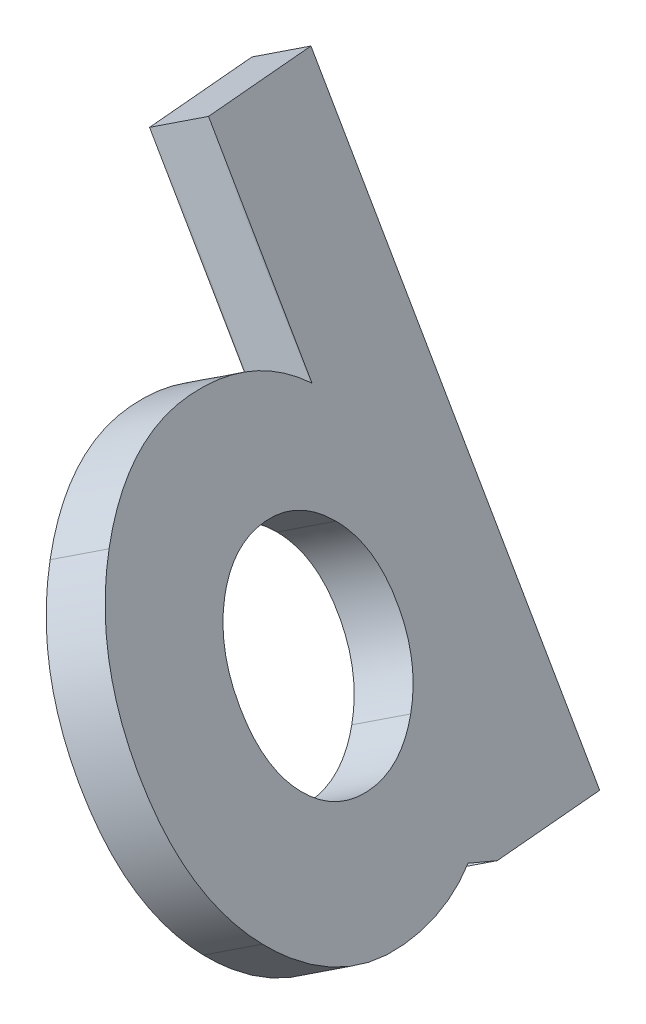
ISO-10303-21;
HEADER;
FILE_DESCRIPTION(('STEP AP214'),'2;1');
FILE_NAME('part.step','',(''),(''),'','','');
FILE_SCHEMA(('AUTOMOTIVE_DESIGN { 1 0 10303 214 1 1 1 1 }'));
ENDSEC;
DATA;
#1=APPLICATION_CONTEXT('core data for automotive mechanical design processes');
#2=APPLICATION_PROTOCOL_DEFINITION('international standard','automotive_design',2000,#1);
#3=PRODUCT_CONTEXT('',#1,'mechanical');
#4=PRODUCT('Part','Part','',(#3));
#5=PRODUCT_RELATED_PRODUCT_CATEGORY('part','',(#4));
#6=PRODUCT_DEFINITION_FORMATION('','',#4);
#7=PRODUCT_DEFINITION_CONTEXT('part definition',#1,'design');
#8=PRODUCT_DEFINITION('design','',#6,#7);
#9=PRODUCT_DEFINITION_SHAPE('','',#8);
#10=(LENGTH_UNIT() NAMED_UNIT(*) SI_UNIT(.MILLI.,.METRE.));
#11=(NAMED_UNIT(*) PLANE_ANGLE_UNIT() SI_UNIT($,.RADIAN.));
#12=(NAMED_UNIT(*) SI_UNIT($,.STERADIAN.) SOLID_ANGLE_UNIT());
#13=UNCERTAINTY_MEASURE_WITH_UNIT(LENGTH_MEASURE(1.E-05),#10,'distance_accuracy_value','');
#14=(GEOMETRIC_REPRESENTATION_CONTEXT(3) GLOBAL_UNCERTAINTY_ASSIGNED_CONTEXT((#13)) GLOBAL_UNIT_ASSIGNED_CONTEXT((#10,
#11,#12)) REPRESENTATION_CONTEXT('',''));
#15=CARTESIAN_POINT('',(0.,0.,0.));
#16=DIRECTION('',(0.,0.,1.));
#17=DIRECTION('',(1.,0.,0.));
#18=AXIS2_PLACEMENT_3D('',#15,#16,#17);
#19=CARTESIAN_POINT('',(8.13974929805619,3.60228000869714,0.00698615585529271));
#20=DIRECTION('',(0.847100670886275,0.489073800366902,-0.207911690817759));
#21=DIRECTION('',(0.,-0.391228817833811,-0.920293438038303));
#22=AXIS2_PLACEMENT_3D('',#19,#20,#21);
#23=PLANE('',#22);
#24=CARTESIAN_POINT('',(7.92501048505287,4.0366960484203,0.153952932024193));
#25=CARTESIAN_POINT('',(7.85690880548298,4.1129926074321,0.0559578154379937));
#26=CARTESIAN_POINT('',(7.78376283362679,4.21886664286758,0.0069861346182927));
#27=CARTESIAN_POINT('',(7.62872130503954,4.48740644766383,0.0069861346182927));
#28=CARTESIAN_POINT('',(7.57395154888874,4.60308895222363,0.0559578154379937));
#29=CARTESIAN_POINT('',(7.54123684543957,4.70141149083617,0.153952932024193));
#30=B_SPLINE_CURVE_WITH_KNOTS('',3,(#24,#25,#26,#27,#28,#29),.UNSPECIFIED.,.F.,.F.,(4,2,4),(0.,
0.5,1.),.UNSPECIFIED.);
#31=CARTESIAN_POINT('',(7.92501048505287,4.0366960484203,0.153952932024193));
#32=VERTEX_POINT('',#31);
#33=CARTESIAN_POINT('',(7.54123684543957,4.70141149083617,0.153952932024193));
#34=VERTEX_POINT('',#33);
#35=EDGE_CURVE('E182',#32,#34,#30,.T.);
#36=ORIENTED_EDGE('',*,*,#35,.T.);
#37=CARTESIAN_POINT('',(7.54123684543957,4.70141149083617,0.153952932024193));
#38=CARTESIAN_POINT('',(7.50848510082189,4.79977374029332,0.251890543113894));
#39=CARTESIAN_POINT('',(7.50447635309023,4.85606447943902,0.367971138349393));
#40=CARTESIAN_POINT('',(7.55536756954593,4.8854465369591,0.644434563324293));
#41=CARTESIAN_POINT('',(7.60190409236223,4.85447632162579,0.761187972868893));
#42=CARTESIAN_POINT('',(7.66877219387898,4.77742682494417,0.852385939768692));
#43=B_SPLINE_CURVE_WITH_KNOTS('',3,(#37,#38,#39,#40,#41,#42),.UNSPECIFIED.,.F.,.F.,(4,2,4),(0.,
0.5,1.),.UNSPECIFIED.);
#44=CARTESIAN_POINT('',(7.66877219387898,4.77742682494417,0.852385939768692));
#45=VERTEX_POINT('',#44);
#46=EDGE_CURVE('E187',#34,#45,#43,.T.);
#47=ORIENTED_EDGE('',*,*,#46,.T.);
#48=CARTESIAN_POINT('',(7.66877219387898,4.77742682494417,0.852385939768692));
#49=CARTESIAN_POINT('',(7.73563315175155,4.7004139349265,0.943640911517291));
#50=CARTESIAN_POINT('',(7.80816645511693,4.59419296368102,0.989300276891994));
#51=CARTESIAN_POINT('',(7.96593584921547,4.32092835722297,0.989300276891994));
#52=CARTESIAN_POINT('',(8.02203257484772,4.20435558286552,0.943640911517291));
#53=CARTESIAN_POINT('',(8.05460936968724,4.10913723299537,0.852385939768692));
#54=B_SPLINE_CURVE_WITH_KNOTS('',3,(#48,#49,#50,#51,#52,#53),.UNSPECIFIED.,.F.,.F.,(4,2,4),(0.,
0.5,1.),.UNSPECIFIED.);
#55=CARTESIAN_POINT('',(8.05460936968724,4.10913723299537,0.852385939768692));
#56=VERTEX_POINT('',#55);
#57=EDGE_CURVE('E192',#45,#56,#54,.T.);
#58=ORIENTED_EDGE('',*,*,#57,.T.);
#59=CARTESIAN_POINT('',(8.05460936968724,4.10913723299537,0.852385939768692));
#60=CARTESIAN_POINT('',(8.08722605304665,4.01387402769144,0.761187972868893));
#61=CARTESIAN_POINT('',(8.09042016462741,3.95870825755641,0.644434563324293));
#62=CARTESIAN_POINT('',(8.0395289481717,3.92932620003633,0.367971138349393));
#63=CARTESIAN_POINT('',(7.99313097414899,3.96034246401217,0.251890543113894));
#64=CARTESIAN_POINT('',(7.92501048505287,4.0366960484203,0.153952932024193));
#65=B_SPLINE_CURVE_WITH_KNOTS('',3,(#59,#60,#61,#62,#63,#64),.UNSPECIFIED.,.F.,.F.,(4,2,4),(0.,
0.5,1.),.UNSPECIFIED.);
#66=EDGE_CURVE('E28',#56,#32,#65,.T.);
#67=ORIENTED_EDGE('',*,*,#66,.T.);
#68=EDGE_LOOP('',(#36,#47,#58,#67));
#69=FACE_BOUND('',#68,.T.);
#70=DIRECTION('',(0.180058316317218,0.103953229446891,0.978147600729343));
#71=VECTOR('',#70,1.);
#72=CARTESIAN_POINT('',(8.22207705533894,3.45968394339314,0.00698566935638904));
#73=LINE('',#72,#71);
#74=CARTESIAN_POINT('',(8.10350479797039,3.39123140260078,-0.637138682231324));
#75=VERTEX_POINT('',#74);
#76=CARTESIAN_POINT('',(8.22207829788634,3.45968466077426,0.00699241939609331));
#77=VERTEX_POINT('',#76);
#78=EDGE_CURVE('E209',#75,#77,#73,.T.);
#79=ORIENTED_EDGE('',*,*,#78,.T.);
#80=CARTESIAN_POINT('',(8.34382726647798,3.81272012126446,1.33348842458966));
#81=CARTESIAN_POINT('',(8.41069927036241,3.61531941689409,1.14159833331776));
#82=CARTESIAN_POINT('',(8.41893495632995,3.50207644400541,0.908770079087259));
#83=CARTESIAN_POINT('',(8.32160693391121,3.44588408406225,0.380041542064858));
#84=CARTESIAN_POINT('',(8.24534928943918,3.48896684888425,0.170687031505757));
#85=CARTESIAN_POINT('',(8.13975154390663,3.60227730323723,0.00698894209475755));
#86=(BOUNDED_CURVE() B_SPLINE_CURVE(3,(#80,#81,#82,#83,#84,#85),.UNSPECIFIED.,.F.,
.F.) B_SPLINE_CURVE_WITH_KNOTS((4,2,4),(0.,0.5,1.),
.UNSPECIFIED.) CURVE() GEOMETRIC_REPRESENTATION_ITEM() RATIONAL_B_SPLINE_CURVE((1.,1.,1.,1.,1.,1.)) REPRESENTATION_ITEM(''));
#87=CARTESIAN_POINT('',(8.13975154390663,3.60227730323723,0.00698894209479224));
#88=VERTEX_POINT('',#87);
#89=EDGE_CURVE('E214',#77,#88,#86,.T.);
#90=ORIENTED_EDGE('',*,*,#89,.T.);
#91=CARTESIAN_POINT('',(8.13975154390663,3.60227730323723,0.00698894209479224));
#92=CARTESIAN_POINT('',(8.24534928943918,3.48896684888424,0.170687031505792));
#93=CARTESIAN_POINT('',(8.32160693391121,3.44588408406225,0.380041542064793));
#94=CARTESIAN_POINT('',(8.41893495632995,3.5020764440054,0.908770079087294));
#95=CARTESIAN_POINT('',(8.41069927036242,3.61531941689409,1.14159833331769));
#96=CARTESIAN_POINT('',(8.34382726647798,3.81272012126446,1.33348842458959));
#97=B_SPLINE_CURVE_WITH_KNOTS('',3,(#91,#92,#93,#94,#95,#96),.UNSPECIFIED.,.F.,.F.,(4,2,4),(0.,
0.5,1.),.UNSPECIFIED.);
#98=CARTESIAN_POINT('',(8.34382726647798,3.81272012126446,1.33348842458959));
#99=VERTEX_POINT('',#98);
#100=EDGE_CURVE('E175',#88,#99,#97,.T.);
#101=ORIENTED_EDGE('',*,*,#100,.T.);
#102=CARTESIAN_POINT('',(8.34382726647798,3.81272012126446,1.33348842458959));
#103=CARTESIAN_POINT('',(8.27692880700128,4.01016664806479,1.52537851586149));
#104=CARTESIAN_POINT('',(8.16323529976981,4.24789052258737,1.62135518952049));
#105=CARTESIAN_POINT('',(7.84359295526476,4.80152730352056,1.62135518952049));
#106=CARTESIAN_POINT('',(7.69489695911605,5.01827538022522,1.52537851586149));
#107=CARTESIAN_POINT('',(7.55667639339899,5.17610542665947,1.33348842458959));
#108=B_SPLINE_CURVE_WITH_KNOTS('',3,(#102,#103,#104,#105,#106,#107),.UNSPECIFIED.,.F.,.F.,(4,2,
4),(0.,0.5,1.),.UNSPECIFIED.);
#109=CARTESIAN_POINT('',(7.55667639339899,5.17610542665947,1.33348842458959));
#110=VERTEX_POINT('',#109);
#111=EDGE_CURVE('E211',#99,#110,#108,.T.);
#112=ORIENTED_EDGE('',*,*,#111,.T.);
#113=CARTESIAN_POINT('',(7.55667639339899,5.17610542665947,1.33348842458959));
#114=CARTESIAN_POINT('',(7.4184705252332,5.33391001618821,1.14159833331769));
#115=CARTESIAN_POINT('',(7.32415551713465,5.39829005577343,0.908770079087294));
#116=CARTESIAN_POINT('',(7.22682749471591,5.34209769583028,0.380041542064793));
#117=CARTESIAN_POINT('',(7.22602413883226,5.25448979916823,0.170687031505792));
#118=CARTESIAN_POINT('',(7.27134448739185,5.10640124569306,0.00698611677869311));
#119=B_SPLINE_CURVE_WITH_KNOTS('',3,(#113,#114,#115,#116,#117,#118),.UNSPECIFIED.,.F.,.F.,(4,2,
4),(0.,0.5,1.),.UNSPECIFIED.);
#120=CARTESIAN_POINT('',(7.27134448739185,5.10640124569306,0.00698611677869311));
#121=VERTEX_POINT('',#120);
#122=EDGE_CURVE('E204',#110,#121,#119,.T.);
#123=ORIENTED_EDGE('',*,*,#122,.T.);
#124=CARTESIAN_POINT('',(7.27134669604408,5.10639688956427,0.00698486856649284));
#125=CARTESIAN_POINT('',(7.27134202453587,5.1064056106781,0.00698635011299291));
#126=CARTESIAN_POINT('',(6.74041406791103,6.02600134043649,0.00698995791759312));
#127=CARTESIAN_POINT('',(6.74040727179756,6.02601231346043,0.00698808032629367));
#128=B_SPLINE_CURVE_WITH_KNOTS('',3,(#124,#125,#126,#127),.UNSPECIFIED.,.F.,.F.,(4,4),(0.,1.),.UNSPECIFIED.);
#129=CARTESIAN_POINT('',(6.74040727179758,6.0260123134604,0.00698808032629367));
#130=VERTEX_POINT('',#129);
#131=EDGE_CURVE('E50',#121,#130,#128,.T.);
#132=ORIENTED_EDGE('',*,*,#131,.T.);
#133=CARTESIAN_POINT('',(6.74040727179756,6.02601231346043,0.00698808032629367));
#134=CARTESIAN_POINT('',(6.74041029266953,6.0260027223863,0.00697782712099325));
#135=CARTESIAN_POINT('',(6.62183923957443,5.95755412232963,-0.637132348006027));
#136=CARTESIAN_POINT('',(6.62183787645235,5.9575511188187,-0.637144967020817));
#137=B_SPLINE_CURVE_WITH_KNOTS('',3,(#133,#134,#135,#136),.UNSPECIFIED.,.F.,.F.,(4,4),(0.,1.),.UNSPECIFIED.);
#138=CARTESIAN_POINT('',(6.62183787645276,5.95755111881958,-0.637144967017117));
#139=VERTEX_POINT('',#138);
#140=EDGE_CURVE('E152',#130,#139,#137,.T.);
#141=ORIENTED_EDGE('',*,*,#140,.T.);
#142=CARTESIAN_POINT('',(6.62183787645235,5.9575511188187,-0.637144967020817));
#143=CARTESIAN_POINT('',(6.62184488512081,5.95754306139334,-0.637135364996958));
#144=CARTESIAN_POINT('',(8.10351108140101,3.39122051937792,-0.637138682235496));
#145=CARTESIAN_POINT('',(8.10350355604557,3.39123355367766,-0.637138682231298));
#146=B_SPLINE_CURVE_WITH_KNOTS('',3,(#142,#143,#144,#145),.UNSPECIFIED.,.F.,.F.,(4,4),(0.,1.),.UNSPECIFIED.);
#147=EDGE_CURVE('E170',#139,#75,#146,.T.);
#148=ORIENTED_EDGE('',*,*,#147,.T.);
#149=EDGE_LOOP('',(#79,#90,#101,#112,#123,#132,#141,#148));
#150=FACE_BOUND('',#149,.T.);
#151=ADVANCED_FACE('F16',(#69,#150),#23,.F.);
#152=CARTESIAN_POINT('',(8.38257019710534,3.74247272012803,-0.0526116055706086));
#153=DIRECTION('',(0.847100670886275,0.489073800366902,-0.207911690817759));
#154=DIRECTION('',(0.,-0.391228817833811,-0.920293438038303));
#155=AXIS2_PLACEMENT_3D('',#152,#153,#154);
#156=PLANE('',#155);
#157=CARTESIAN_POINT('',(8.16783138410201,4.17688875985119,0.0943551705982933));
#158=CARTESIAN_POINT('',(8.09972970453213,4.25318531886299,-0.00363994598790579));
#159=CARTESIAN_POINT('',(8.02658373267593,4.35905935429846,-0.0526116268076068));
#160=CARTESIAN_POINT('',(7.87154220408868,4.62759915909472,-0.0526116268076068));
#161=CARTESIAN_POINT('',(7.81677244793789,4.74328166365452,-0.00363994598790579));
#162=CARTESIAN_POINT('',(7.78405774448871,4.84160420226706,0.0943551705982933));
#163=B_SPLINE_CURVE_WITH_KNOTS('',3,(#157,#158,#159,#160,#161,#162),.UNSPECIFIED.,.F.,.F.,(4,2,
4),(0.,0.5,1.),.UNSPECIFIED.);
#164=CARTESIAN_POINT('',(8.16783138410202,4.1768887598512,0.0943551705982933));
#165=VERTEX_POINT('',#164);
#166=CARTESIAN_POINT('',(7.78405774448872,4.84160420226707,0.0943551705982933));
#167=VERTEX_POINT('',#166);
#168=EDGE_CURVE('E181',#165,#167,#163,.T.);
#169=ORIENTED_EDGE('',*,*,#168,.F.);
#170=CARTESIAN_POINT('',(8.29743026873638,4.24932994442626,0.792788178342793));
#171=CARTESIAN_POINT('',(8.3300469520958,4.15406673912233,0.701590211442992));
#172=CARTESIAN_POINT('',(8.33324106367656,4.09890096898731,0.584836801898391));
#173=CARTESIAN_POINT('',(8.28234984722085,4.06951891146722,0.308373376923493));
#174=CARTESIAN_POINT('',(8.23595187319814,4.10053517544306,0.192292781687992));
#175=CARTESIAN_POINT('',(8.16783138410201,4.17688875985119,0.0943551705982933));
#176=B_SPLINE_CURVE_WITH_KNOTS('',3,(#170,#171,#172,#173,#174,#175),.UNSPECIFIED.,.F.,.F.,(4,2,
4),(0.,0.5,1.),.UNSPECIFIED.);
#177=CARTESIAN_POINT('',(8.29743026873639,4.24932994442627,0.792788178342793));
#178=VERTEX_POINT('',#177);
#179=EDGE_CURVE('E11',#178,#165,#176,.T.);
#180=ORIENTED_EDGE('',*,*,#179,.F.);
#181=CARTESIAN_POINT('',(7.91159309292812,4.91761953637506,0.792788178342793));
#182=CARTESIAN_POINT('',(7.9784540508007,4.84060664635739,0.884043150091393));
#183=CARTESIAN_POINT('',(8.05098735416607,4.73438567511191,0.929702515466093));
#184=CARTESIAN_POINT('',(8.20875674826462,4.46112106865386,0.929702515466093));
#185=CARTESIAN_POINT('',(8.26485347389687,4.34454829429641,0.884043150091393));
#186=CARTESIAN_POINT('',(8.29743026873638,4.24932994442626,0.792788178342793));
#187=B_SPLINE_CURVE_WITH_KNOTS('',3,(#181,#182,#183,#184,#185,#186),.UNSPECIFIED.,.F.,.F.,(4,2,
4),(0.,0.5,1.),.UNSPECIFIED.);
#188=CARTESIAN_POINT('',(7.91159309292813,4.91761953637507,0.792788178342793));
#189=VERTEX_POINT('',#188);
#190=EDGE_CURVE('E199',#189,#178,#187,.T.);
#191=ORIENTED_EDGE('',*,*,#190,.F.);
#192=CARTESIAN_POINT('',(7.78405774448871,4.84160420226706,0.0943551705982933));
#193=CARTESIAN_POINT('',(7.75130599987103,4.9399664517242,0.192292781687992));
#194=CARTESIAN_POINT('',(7.74729725213938,4.99625719086991,0.308373376923493));
#195=CARTESIAN_POINT('',(7.79818846859509,5.02563924839,0.584836801898391));
#196=CARTESIAN_POINT('',(7.84472499141138,4.99466903305669,0.701590211442992));
#197=CARTESIAN_POINT('',(7.91159309292812,4.91761953637506,0.792788178342793));
#198=B_SPLINE_CURVE_WITH_KNOTS('',3,(#192,#193,#194,#195,#196,#197),.UNSPECIFIED.,.F.,.F.,(4,2,
4),(0.,0.5,1.),.UNSPECIFIED.);
#199=EDGE_CURVE('E193',#167,#189,#198,.T.);
#200=ORIENTED_EDGE('',*,*,#199,.F.);
#201=EDGE_LOOP('',(#169,#180,#191,#200));
#202=FACE_BOUND('',#201,.T.);
#203=DIRECTION('',(0.180058316317218,0.103953229446891,0.978147600729343));
#204=VECTOR('',#203,1.);
#205=CARTESIAN_POINT('',(8.3463260467686,3.53142142892372,-0.696741334884272));
#206=LINE('',#205,#204);
#207=CARTESIAN_POINT('',(8.34632569701954,3.53142411403167,-0.696736443657217));
#208=VERTEX_POINT('',#207);
#209=CARTESIAN_POINT('',(8.46489919693481,3.59987737220499,-0.0526053420298062));
#210=VERTEX_POINT('',#209);
#211=EDGE_CURVE('E198',#208,#210,#206,.T.);
#212=ORIENTED_EDGE('',*,*,#211,.F.);
#213=CARTESIAN_POINT('',(6.8646587755035,6.09774383024809,-0.696742728442857));
#214=CARTESIAN_POINT('',(6.86466578417076,6.09773577282279,-0.696733126422997));
#215=CARTESIAN_POINT('',(8.34633198045016,3.53141323080881,-0.696736443661408));
#216=CARTESIAN_POINT('',(8.34632445509472,3.53142626510856,-0.696736443657198));
#217=B_SPLINE_CURVE_WITH_KNOTS('',3,(#213,#214,#215,#216),.UNSPECIFIED.,.F.,.F.,(4,4),(0.,1.),.UNSPECIFIED.);
#218=CARTESIAN_POINT('',(6.86465877550354,6.09774383024815,-0.696742728442636));
#219=VERTEX_POINT('',#218);
#220=EDGE_CURVE('E143',#219,#208,#217,.T.);
#221=ORIENTED_EDGE('',*,*,#220,.F.);
#222=CARTESIAN_POINT('',(6.98322817084794,6.16620502489208,-0.0526096810999077));
#223=CARTESIAN_POINT('',(6.9832311917177,6.16619543381665,-0.0526199343046079));
#224=CARTESIAN_POINT('',(6.86466013862239,6.09774683376158,-0.696730109432586));
#225=CARTESIAN_POINT('',(6.8646587755035,6.09774383024809,-0.696742728442857));
#226=B_SPLINE_CURVE_WITH_KNOTS('',3,(#222,#223,#224,#225),.UNSPECIFIED.,.F.,.F.,(4,4),(0.,1.),.UNSPECIFIED.);
#227=CARTESIAN_POINT('',(6.98322817084797,6.16620502489203,-0.0526096810999077));
#228=VERTEX_POINT('',#227);
#229=EDGE_CURVE('E20',#228,#219,#226,.T.);
#230=ORIENTED_EDGE('',*,*,#229,.F.);
#231=CARTESIAN_POINT('',(7.51416759509323,5.24658960099516,-0.0526128928594084));
#232=CARTESIAN_POINT('',(7.51416292358501,5.24659832210899,-0.0526114113129084));
#233=CARTESIAN_POINT('',(6.98323496695968,6.16619405186707,-0.0526078035082075));
#234=CARTESIAN_POINT('',(6.98322817084794,6.16620502489208,-0.0526096810999077));
#235=B_SPLINE_CURVE_WITH_KNOTS('',3,(#231,#232,#233,#234),.UNSPECIFIED.,.F.,.F.,(4,4),(0.,1.),.UNSPECIFIED.);
#236=CARTESIAN_POINT('',(7.514165386441,5.24659395712395,-0.0526116446472082));
#237=VERTEX_POINT('',#236);
#238=EDGE_CURVE('E41',#237,#228,#235,.T.);
#239=ORIENTED_EDGE('',*,*,#238,.F.);
#240=CARTESIAN_POINT('',(7.79949729244815,5.31629813809037,1.27389066316369));
#241=CARTESIAN_POINT('',(7.66129142428235,5.4741027276191,1.08200057189179));
#242=CARTESIAN_POINT('',(7.5669764161838,5.53848276720432,0.849172317661394));
#243=CARTESIAN_POINT('',(7.46964839376505,5.48229040726116,0.320443780638892));
#244=CARTESIAN_POINT('',(7.46884503788141,5.39468251059912,0.111089270079892));
#245=CARTESIAN_POINT('',(7.51416538644099,5.24659395712395,-0.0526116446472082));
#246=B_SPLINE_CURVE_WITH_KNOTS('',3,(#240,#241,#242,#243,#244,#245),.UNSPECIFIED.,.F.,.F.,(4,2,
4),(0.,0.5,1.),.UNSPECIFIED.);
#247=CARTESIAN_POINT('',(7.79949729244815,5.31629813809037,1.27389066316369));
#248=VERTEX_POINT('',#247);
#249=EDGE_CURVE('E208',#248,#237,#246,.T.);
#250=ORIENTED_EDGE('',*,*,#249,.F.);
#251=CARTESIAN_POINT('',(8.58664816552713,3.95291283269536,1.27389066316369));
#252=CARTESIAN_POINT('',(8.51974970605043,4.15035935949569,1.46578075443559));
#253=CARTESIAN_POINT('',(8.40605619881897,4.38808323401827,1.56175742809459));
#254=CARTESIAN_POINT('',(8.08641385431391,4.94172001495146,1.56175742809459));
#255=CARTESIAN_POINT('',(7.9377178581652,5.15846809165612,1.46578075443559));
#256=CARTESIAN_POINT('',(7.79949729244815,5.31629813809037,1.27389066316369));
#257=B_SPLINE_CURVE_WITH_KNOTS('',3,(#251,#252,#253,#254,#255,#256),.UNSPECIFIED.,.F.,.F.,(4,2,
4),(0.,0.5,1.),.UNSPECIFIED.);
#258=CARTESIAN_POINT('',(8.58664816552713,3.95291283269536,1.27389066316369));
#259=VERTEX_POINT('',#258);
#260=EDGE_CURVE('E205',#259,#248,#257,.T.);
#261=ORIENTED_EDGE('',*,*,#260,.F.);
#262=CARTESIAN_POINT('',(8.38257244295587,3.74247001466835,-0.052608819329206));
#263=CARTESIAN_POINT('',(8.48817018848833,3.62915956031514,0.111089270079892));
#264=CARTESIAN_POINT('',(8.56442783296035,3.58607679549314,0.320443780638892));
#265=CARTESIAN_POINT('',(8.6617558553791,3.6422691554363,0.849172317661394));
#266=CARTESIAN_POINT('',(8.65352016941156,3.75551212832498,1.08200057189179));
#267=CARTESIAN_POINT('',(8.58664816552713,3.95291283269536,1.27389066316369));
#268=B_SPLINE_CURVE_WITH_KNOTS('',3,(#262,#263,#264,#265,#266,#267),.UNSPECIFIED.,.F.,.F.,(4,2,
4),(0.,0.5,1.),.UNSPECIFIED.);
#269=CARTESIAN_POINT('',(8.38257244295579,3.74247001466812,-0.0526088193311403));
#270=VERTEX_POINT('',#269);
#271=EDGE_CURVE('E176',#270,#259,#268,.T.);
#272=ORIENTED_EDGE('',*,*,#271,.F.);
#273=CARTESIAN_POINT('',(8.58664816552714,3.95291283269536,1.27389066316376));
#274=CARTESIAN_POINT('',(8.65352016941156,3.75551212832498,1.08200057189186));
#275=CARTESIAN_POINT('',(8.6617558553791,3.6422691554363,0.849172317661361));
#276=CARTESIAN_POINT('',(8.56442783296036,3.58607679549315,0.32044378063896));
#277=CARTESIAN_POINT('',(8.48817018848834,3.62915956031514,0.11108927007986));
#278=CARTESIAN_POINT('',(8.38257244295579,3.74247001466812,-0.0526088193311403));
#279=(BOUNDED_CURVE() B_SPLINE_CURVE(3,(#273,#274,#275,#276,#277,#278),.UNSPECIFIED.,.F.,
.F.) B_SPLINE_CURVE_WITH_KNOTS((4,2,4),(0.,0.5,1.),
.UNSPECIFIED.) CURVE() GEOMETRIC_REPRESENTATION_ITEM() RATIONAL_B_SPLINE_CURVE((1.,1.,1.,1.,1.,1.)) REPRESENTATION_ITEM(''));
#280=EDGE_CURVE('E228',#210,#270,#279,.T.);
#281=ORIENTED_EDGE('',*,*,#280,.F.);
#282=EDGE_LOOP('',(#212,#221,#230,#239,#250,#261,#272,#281));
#283=FACE_BOUND('',#282,.T.);
#284=ADVANCED_FACE('F18',(#202,#283),#156,.T.);
#285=CARTESIAN_POINT('',(8.19577818823004,4.19064108838224,0.817737581240992));
#286=CARTESIAN_POINT('',(8.22839487158944,4.0953778830783,0.726539614341092));
#287=CARTESIAN_POINT('',(8.2315889831702,4.04021211294328,0.609786204796492));
#288=CARTESIAN_POINT('',(8.18069776671449,4.01083005542319,0.333322779821593));
#289=CARTESIAN_POINT('',(8.13429979269178,4.04184631939903,0.217242184586092));
#290=CARTESIAN_POINT('',(8.06617930359567,4.11819990380717,0.119304573496393));
#291=(BOUNDED_CURVE() B_SPLINE_CURVE(3,(#285,#286,#287,#288,#289,#290),.UNSPECIFIED.,.F.,
.F.) B_SPLINE_CURVE_WITH_KNOTS((4,2,4),(0.,0.5,1.),
.UNSPECIFIED.) CURVE() GEOMETRIC_REPRESENTATION_ITEM() RATIONAL_B_SPLINE_CURVE((1.,1.,1.,1.,1.,1.)) REPRESENTATION_ITEM(''));
#292=DIRECTION('',(-0.847100670886275,-0.489073800366902,0.207911690817759));
#293=VECTOR('',#292,1.);
#294=SURFACE_OF_LINEAR_EXTRUSION('',#291,#293);
#295=ORIENTED_EDGE('',*,*,#66,.F.);
#296=DIRECTION('',(-0.847100670886275,-0.489073800366902,0.207911690817759));
#297=VECTOR('',#296,1.);
#298=CARTESIAN_POINT('',(8.19577818823004,4.19064108838224,0.817737581240992));
#299=LINE('',#298,#297);
#300=EDGE_CURVE('E194',#178,#56,#299,.T.);
#301=ORIENTED_EDGE('',*,*,#300,.F.);
#302=ORIENTED_EDGE('',*,*,#179,.T.);
#303=DIRECTION('',(-0.847100670886275,-0.489073800366902,0.207911690817759));
#304=VECTOR('',#303,1.);
#305=CARTESIAN_POINT('',(8.06617930359567,4.11819990380717,0.119304573496393));
#306=LINE('',#305,#304);
#307=EDGE_CURVE('E177',#165,#32,#306,.T.);
#308=ORIENTED_EDGE('',*,*,#307,.T.);
#309=EDGE_LOOP('',(#295,#301,#302,#308));
#310=FACE_BOUND('',#309,.T.);
#311=ADVANCED_FACE('F410',(#310),#294,.T.);
#312=CARTESIAN_POINT('',(7.41251551458722,5.18790074495042,-0.0276634899553079));
#313=CARTESIAN_POINT('',(7.4125108430783,5.1879094660652,-0.0276620084169073));
#314=CARTESIAN_POINT('',(6.88158288645329,6.10750519582303,-0.0276584006100068));
#315=CARTESIAN_POINT('',(6.88157609034102,6.1075161688477,-0.0276602782016064));
#316=(BOUNDED_CURVE() B_SPLINE_CURVE(3,(#312,#313,#314,#315),.UNSPECIFIED.,.F.,
.F.) B_SPLINE_CURVE_WITH_KNOTS((4,4),(0.,1.),
.UNSPECIFIED.) CURVE() GEOMETRIC_REPRESENTATION_ITEM() RATIONAL_B_SPLINE_CURVE((1.,1.,1.,1.)) REPRESENTATION_ITEM(''));
#317=DIRECTION('',(-0.847100670886275,-0.489073800366902,0.207911690817759));
#318=VECTOR('',#317,1.);
#319=SURFACE_OF_LINEAR_EXTRUSION('',#316,#318);
#320=ORIENTED_EDGE('',*,*,#238,.T.);
#321=DIRECTION('',(-0.847100670886275,-0.489073800366902,0.207911690817759));
#322=VECTOR('',#321,1.);
#323=CARTESIAN_POINT('',(6.88157609034102,6.1075161688477,-0.0276602782016064));
#324=LINE('',#323,#322);
#325=EDGE_CURVE('E136',#228,#130,#324,.T.);
#326=ORIENTED_EDGE('',*,*,#325,.T.);
#327=ORIENTED_EDGE('',*,*,#131,.F.);
#328=DIRECTION('',(-0.847100670886275,-0.489073800366902,0.207911690817759));
#329=VECTOR('',#328,1.);
#330=CARTESIAN_POINT('',(7.41251330593464,5.18790510107992,-0.0276622417490074));
#331=LINE('',#330,#329);
#332=EDGE_CURVE('E137',#237,#121,#331,.T.);
#333=ORIENTED_EDGE('',*,*,#332,.F.);
#334=EDGE_LOOP('',(#320,#326,#327,#333));
#335=FACE_BOUND('',#334,.T.);
#336=ADVANCED_FACE('F134',(#335),#319,.T.);
#337=CARTESIAN_POINT('',(7.69784521194179,5.25760928204634,1.29884006606189));
#338=CARTESIAN_POINT('',(7.55963934377599,5.41541387157507,1.10694997478999));
#339=CARTESIAN_POINT('',(7.46532433567745,5.47979391116029,0.874121720559494));
#340=CARTESIAN_POINT('',(7.36799631325871,5.42360155121714,0.345393183537093));
#341=CARTESIAN_POINT('',(7.36719295737506,5.33599365455509,0.136038672977993));
#342=CARTESIAN_POINT('',(7.41251330593464,5.18790510107992,-0.0276622417490074));
#343=(BOUNDED_CURVE() B_SPLINE_CURVE(3,(#337,#338,#339,#340,#341,#342),.UNSPECIFIED.,.F.,
.F.) B_SPLINE_CURVE_WITH_KNOTS((4,2,4),(0.,0.5,1.),
.UNSPECIFIED.) CURVE() GEOMETRIC_REPRESENTATION_ITEM() RATIONAL_B_SPLINE_CURVE((1.,1.,1.,1.,1.,1.)) REPRESENTATION_ITEM(''));
#344=DIRECTION('',(-0.847100670886275,-0.489073800366902,0.207911690817759));
#345=VECTOR('',#344,1.);
#346=SURFACE_OF_LINEAR_EXTRUSION('',#343,#345);
#347=ORIENTED_EDGE('',*,*,#122,.F.);
#348=DIRECTION('',(-0.847100670886275,-0.489073800366902,0.207911690817759));
#349=VECTOR('',#348,1.);
#350=CARTESIAN_POINT('',(7.69784521194179,5.25760928204634,1.29884006606189));
#351=LINE('',#350,#349);
#352=EDGE_CURVE('E200',#248,#110,#351,.T.);
#353=ORIENTED_EDGE('',*,*,#352,.F.);
#354=ORIENTED_EDGE('',*,*,#249,.T.);
#355=ORIENTED_EDGE('',*,*,#332,.T.);
#356=EDGE_LOOP('',(#347,#353,#354,#355));
#357=FACE_BOUND('',#356,.T.);
#358=ADVANCED_FACE('F402',(#357),#346,.T.);
#359=CARTESIAN_POINT('',(8.48499608502078,3.89422397665133,1.29884006606189));
#360=CARTESIAN_POINT('',(8.41809762554409,4.09167050345166,1.49073015733369));
#361=CARTESIAN_POINT('',(8.30440411831261,4.32939437797424,1.58670683099279));
#362=CARTESIAN_POINT('',(7.98476177380756,4.88303115890743,1.58670683099279));
#363=CARTESIAN_POINT('',(7.83606577765885,5.09977923561209,1.49073015733369));
#364=CARTESIAN_POINT('',(7.69784521194179,5.25760928204634,1.29884006606189));
#365=(BOUNDED_CURVE() B_SPLINE_CURVE(3,(#359,#360,#361,#362,#363,#364),.UNSPECIFIED.,.F.,
.F.) B_SPLINE_CURVE_WITH_KNOTS((4,2,4),(0.,0.5,1.),
.UNSPECIFIED.) CURVE() GEOMETRIC_REPRESENTATION_ITEM() RATIONAL_B_SPLINE_CURVE((1.,1.,1.,1.,1.,1.)) REPRESENTATION_ITEM(''));
#366=DIRECTION('',(-0.847100670886275,-0.489073800366902,0.207911690817759));
#367=VECTOR('',#366,1.);
#368=SURFACE_OF_LINEAR_EXTRUSION('',#365,#367);
#369=ORIENTED_EDGE('',*,*,#111,.F.);
#370=DIRECTION('',(-0.847100670886275,-0.489073800366902,0.207911690817759));
#371=VECTOR('',#370,1.);
#372=CARTESIAN_POINT('',(8.48499608502078,3.89422397665133,1.29884006606189));
#373=LINE('',#372,#371);
#374=EDGE_CURVE('E171',#259,#99,#373,.T.);
#375=ORIENTED_EDGE('',*,*,#374,.F.);
#376=ORIENTED_EDGE('',*,*,#260,.T.);
#377=ORIENTED_EDGE('',*,*,#352,.T.);
#378=EDGE_LOOP('',(#369,#375,#376,#377));
#379=FACE_BOUND('',#378,.T.);
#380=ADVANCED_FACE('F399',(#379),#368,.T.);
#381=CARTESIAN_POINT('',(8.24467396626219,3.47273257287966,-0.671791931986127));
#382=DIRECTION('',(0.499999456108736,-0.866025717794938,-2.95464367148184E-06));
#383=DIRECTION('',(0.,3.41172740110734E-06,-0.99999999999418));
#384=AXIS2_PLACEMENT_3D('',#381,#382,#383);
#385=PLANE('',#384);
#386=ORIENTED_EDGE('',*,*,#211,.T.);
#387=DIRECTION('',(-0.847100670886275,-0.489073800366902,0.207911690817759));
#388=VECTOR('',#387,1.);
#389=CARTESIAN_POINT('',(8.36324711644148,3.54118851614814,-0.027655939088907));
#390=LINE('',#389,#388);
#391=EDGE_CURVE('E221',#210,#77,#390,.T.);
#392=ORIENTED_EDGE('',*,*,#391,.T.);
#393=ORIENTED_EDGE('',*,*,#78,.F.);
#394=DIRECTION('',(-0.84710067088628,-0.489073800366905,0.207911690817731));
#395=VECTOR('',#394,1.);
#396=CARTESIAN_POINT('',(8.22491648121395,3.46132562145229,-0.666937562944246));
#397=LINE('',#396,#395);
#398=EDGE_CURVE('E166',#208,#75,#397,.T.);
#399=ORIENTED_EDGE('',*,*,#398,.F.);
#400=EDGE_LOOP('',(#386,#392,#393,#399));
#401=FACE_BOUND('',#400,.T.);
#402=ADVANCED_FACE('F390',(#401),#385,.T.);
#403=CARTESIAN_POINT('',(7.80994101242177,4.85893068033104,0.817737581240992));
#404=CARTESIAN_POINT('',(7.87680197029435,4.78191779031336,0.908992552989494));
#405=CARTESIAN_POINT('',(7.94933527365972,4.67569681906788,0.954651918364193));
#406=CARTESIAN_POINT('',(8.10710466775827,4.40243221260984,0.954651918364193));
#407=CARTESIAN_POINT('',(8.16320139339051,4.28585943825238,0.908992552989494));
#408=CARTESIAN_POINT('',(8.19577818823004,4.19064108838224,0.817737581240992));
#409=(BOUNDED_CURVE() B_SPLINE_CURVE(3,(#403,#404,#405,#406,#407,#408),.UNSPECIFIED.,.F.,
.F.) B_SPLINE_CURVE_WITH_KNOTS((4,2,4),(0.,0.5,1.),
.UNSPECIFIED.) CURVE() GEOMETRIC_REPRESENTATION_ITEM() RATIONAL_B_SPLINE_CURVE((1.,1.,1.,1.,1.,1.)) REPRESENTATION_ITEM(''));
#410=DIRECTION('',(-0.847100670886275,-0.489073800366902,0.207911690817759));
#411=VECTOR('',#410,1.);
#412=SURFACE_OF_LINEAR_EXTRUSION('',#409,#411);
#413=ORIENTED_EDGE('',*,*,#57,.F.);
#414=DIRECTION('',(-0.847100670886275,-0.489073800366902,0.207911690817759));
#415=VECTOR('',#414,1.);
#416=CARTESIAN_POINT('',(7.80994101242177,4.85893068033104,0.817737581240992));
#417=LINE('',#416,#415);
#418=EDGE_CURVE('E188',#189,#45,#417,.T.);
#419=ORIENTED_EDGE('',*,*,#418,.F.);
#420=ORIENTED_EDGE('',*,*,#190,.T.);
#421=ORIENTED_EDGE('',*,*,#300,.T.);
#422=EDGE_LOOP('',(#413,#419,#420,#421));
#423=FACE_BOUND('',#422,.T.);
#424=ADVANCED_FACE('F424',(#423),#412,.T.);
#425=CARTESIAN_POINT('',(7.68240566398236,4.78291534622304,0.119304573496393));
#426=CARTESIAN_POINT('',(7.64965391936468,4.88127759568018,0.217242184586092));
#427=CARTESIAN_POINT('',(7.64564517163302,4.93756833482588,0.333322779821593));
#428=CARTESIAN_POINT('',(7.69653638808873,4.96695039234597,0.609786204796492));
#429=CARTESIAN_POINT('',(7.74307291090503,4.93598017701266,0.726539614341092));
#430=CARTESIAN_POINT('',(7.80994101242177,4.85893068033104,0.817737581240992));
#431=(BOUNDED_CURVE() B_SPLINE_CURVE(3,(#425,#426,#427,#428,#429,#430),.UNSPECIFIED.,.F.,
.F.) B_SPLINE_CURVE_WITH_KNOTS((4,2,4),(0.,0.5,1.),
.UNSPECIFIED.) CURVE() GEOMETRIC_REPRESENTATION_ITEM() RATIONAL_B_SPLINE_CURVE((1.,1.,1.,1.,1.,1.)) REPRESENTATION_ITEM(''));
#432=DIRECTION('',(-0.847100670886275,-0.489073800366902,0.207911690817759));
#433=VECTOR('',#432,1.);
#434=SURFACE_OF_LINEAR_EXTRUSION('',#431,#433);
#435=ORIENTED_EDGE('',*,*,#46,.F.);
#436=DIRECTION('',(-0.847100670886275,-0.489073800366902,0.207911690817759));
#437=VECTOR('',#436,1.);
#438=CARTESIAN_POINT('',(7.68240566398236,4.78291534622304,0.119304573496393));
#439=LINE('',#438,#437);
#440=EDGE_CURVE('E183',#167,#34,#439,.T.);
#441=ORIENTED_EDGE('',*,*,#440,.F.);
#442=ORIENTED_EDGE('',*,*,#199,.T.);
#443=ORIENTED_EDGE('',*,*,#418,.T.);
#444=EDGE_LOOP('',(#435,#441,#442,#443));
#445=FACE_BOUND('',#444,.T.);
#446=ADVANCED_FACE('F421',(#445),#434,.T.);
#447=CARTESIAN_POINT('',(8.06617930359567,4.11819990380717,0.119304573496393));
#448=CARTESIAN_POINT('',(7.99807762402578,4.19449646281897,0.0213094569101943));
#449=CARTESIAN_POINT('',(7.92493165216959,4.30037049825444,-0.0276622239094079));
#450=CARTESIAN_POINT('',(7.76989012358234,4.56891030305069,-0.0276622239094079));
#451=CARTESIAN_POINT('',(7.71512036743154,4.6845928076105,0.0213094569101943));
#452=CARTESIAN_POINT('',(7.68240566398236,4.78291534622304,0.119304573496393));
#453=(BOUNDED_CURVE() B_SPLINE_CURVE(3,(#447,#448,#449,#450,#451,#452),.UNSPECIFIED.,.F.,
.F.) B_SPLINE_CURVE_WITH_KNOTS((4,2,4),(0.,0.5,1.),
.UNSPECIFIED.) CURVE() GEOMETRIC_REPRESENTATION_ITEM() RATIONAL_B_SPLINE_CURVE((1.,1.,1.,1.,1.,1.)) REPRESENTATION_ITEM(''));
#454=DIRECTION('',(-0.847100670886275,-0.489073800366902,0.207911690817759));
#455=VECTOR('',#454,1.);
#456=SURFACE_OF_LINEAR_EXTRUSION('',#453,#455);
#457=ORIENTED_EDGE('',*,*,#35,.F.);
#458=ORIENTED_EDGE('',*,*,#307,.F.);
#459=ORIENTED_EDGE('',*,*,#168,.T.);
#460=ORIENTED_EDGE('',*,*,#440,.T.);
#461=EDGE_LOOP('',(#457,#458,#459,#460));
#462=FACE_BOUND('',#461,.T.);
#463=ADVANCED_FACE('F451',(#462),#456,.T.);
#464=CARTESIAN_POINT('',(8.28092036244943,3.68378115862409,-0.0276594164330072));
#465=CARTESIAN_POINT('',(8.38651810798198,3.57047070427111,0.136038672977993));
#466=CARTESIAN_POINT('',(8.462775752454,3.52738793944912,0.345393183537093));
#467=CARTESIAN_POINT('',(8.56010377487275,3.58358029939227,0.874121720559494));
#468=CARTESIAN_POINT('',(8.55186808890521,3.69682327228095,1.10694997478999));
#469=CARTESIAN_POINT('',(8.48499608502078,3.89422397665133,1.29884006606189));
#470=(BOUNDED_CURVE() B_SPLINE_CURVE(3,(#464,#465,#466,#467,#468,#469),.UNSPECIFIED.,.F.,
.F.) B_SPLINE_CURVE_WITH_KNOTS((4,2,4),(0.,0.5,1.),
.UNSPECIFIED.) CURVE() GEOMETRIC_REPRESENTATION_ITEM() RATIONAL_B_SPLINE_CURVE((1.,1.,1.,1.,1.,1.)) REPRESENTATION_ITEM(''));
#471=DIRECTION('',(-0.847100670886275,-0.489073800366902,0.207911690817759));
#472=VECTOR('',#471,1.);
#473=SURFACE_OF_LINEAR_EXTRUSION('',#470,#472);
#474=ORIENTED_EDGE('',*,*,#391,.F.);
#475=ORIENTED_EDGE('',*,*,#280,.T.);
#476=ORIENTED_EDGE('',*,*,#271,.T.);
#477=ORIENTED_EDGE('',*,*,#374,.T.);
#478=ORIENTED_EDGE('',*,*,#100,.F.);
#479=ORIENTED_EDGE('',*,*,#89,.F.);
#480=EDGE_LOOP('',(#474,#475,#476,#477,#478,#479));
#481=FACE_BOUND('',#480,.T.);
#482=ADVANCED_FACE('F396',(#481),#473,.T.);
#483=CARTESIAN_POINT('',(6.76300669499728,6.03905497420412,-0.671793325544696));
#484=CARTESIAN_POINT('',(6.76301370366432,6.03904691677865,-0.671783723524857));
#485=CARTESIAN_POINT('',(8.24467989994382,3.47272437476479,-0.671787040763257));
#486=CARTESIAN_POINT('',(8.24467237458838,3.47273740906453,-0.671787040759058));
#487=(BOUNDED_CURVE() B_SPLINE_CURVE(3,(#483,#484,#485,#486),.UNSPECIFIED.,.F.,
.F.) B_SPLINE_CURVE_WITH_KNOTS((4,4),(0.,1.),
.UNSPECIFIED.) CURVE() GEOMETRIC_REPRESENTATION_ITEM() RATIONAL_B_SPLINE_CURVE((1.,1.,1.,1.)) REPRESENTATION_ITEM(''));
#488=DIRECTION('',(-0.847100670886275,-0.489073800366902,0.207911690817759));
#489=VECTOR('',#488,1.);
#490=SURFACE_OF_LINEAR_EXTRUSION('',#487,#489);
#491=DIRECTION('',(-0.847100670886275,-0.489073800366902,0.207911690817759));
#492=VECTOR('',#491,1.);
#493=CARTESIAN_POINT('',(6.76300669499728,6.03905497420412,-0.671793325544696));
#494=LINE('',#493,#492);
#495=EDGE_CURVE('E148',#219,#139,#494,.T.);
#496=ORIENTED_EDGE('',*,*,#495,.F.);
#497=ORIENTED_EDGE('',*,*,#220,.T.);
#498=ORIENTED_EDGE('',*,*,#398,.T.);
#499=ORIENTED_EDGE('',*,*,#147,.F.);
#500=EDGE_LOOP('',(#496,#497,#498,#499));
#501=FACE_BOUND('',#500,.T.);
#502=ADVANCED_FACE('F387',(#501),#490,.T.);
#503=CARTESIAN_POINT('',(6.88157609034102,6.1075161688477,-0.0276602782016064));
#504=CARTESIAN_POINT('',(6.88157911121193,6.10750657777294,-0.0276705314066067));
#505=CARTESIAN_POINT('',(6.76300805811603,6.03905797771754,-0.671780706534458));
#506=CARTESIAN_POINT('',(6.76300669499728,6.03905497420412,-0.671793325544696));
#507=(BOUNDED_CURVE() B_SPLINE_CURVE(3,(#503,#504,#505,#506),.UNSPECIFIED.,.F.,
.F.) B_SPLINE_CURVE_WITH_KNOTS((4,4),(0.,1.),
.UNSPECIFIED.) CURVE() GEOMETRIC_REPRESENTATION_ITEM() RATIONAL_B_SPLINE_CURVE((1.,1.,1.,1.)) REPRESENTATION_ITEM(''));
#508=DIRECTION('',(-0.847100670886275,-0.489073800366902,0.207911690817759));
#509=VECTOR('',#508,1.);
#510=SURFACE_OF_LINEAR_EXTRUSION('',#507,#509);
#511=ORIENTED_EDGE('',*,*,#325,.F.);
#512=ORIENTED_EDGE('',*,*,#229,.T.);
#513=ORIENTED_EDGE('',*,*,#495,.T.);
#514=ORIENTED_EDGE('',*,*,#140,.F.);
#515=EDGE_LOOP('',(#511,#512,#513,#514));
#516=FACE_BOUND('',#515,.T.);
#517=ADVANCED_FACE('F150',(#516),#510,.T.);
#518=CLOSED_SHELL('',(#151,#284,#311,#336,#358,#380,#402,#424,#446,#463,#482,#502,#517));
#519=MANIFOLD_SOLID_BREP('B1',#518);
#520=ADVANCED_BREP_SHAPE_REPRESENTATION('',(#18,#519),#14);
#521=SHAPE_DEFINITION_REPRESENTATION(#9,#520);
ENDSEC;
END-ISO-10303-21;
